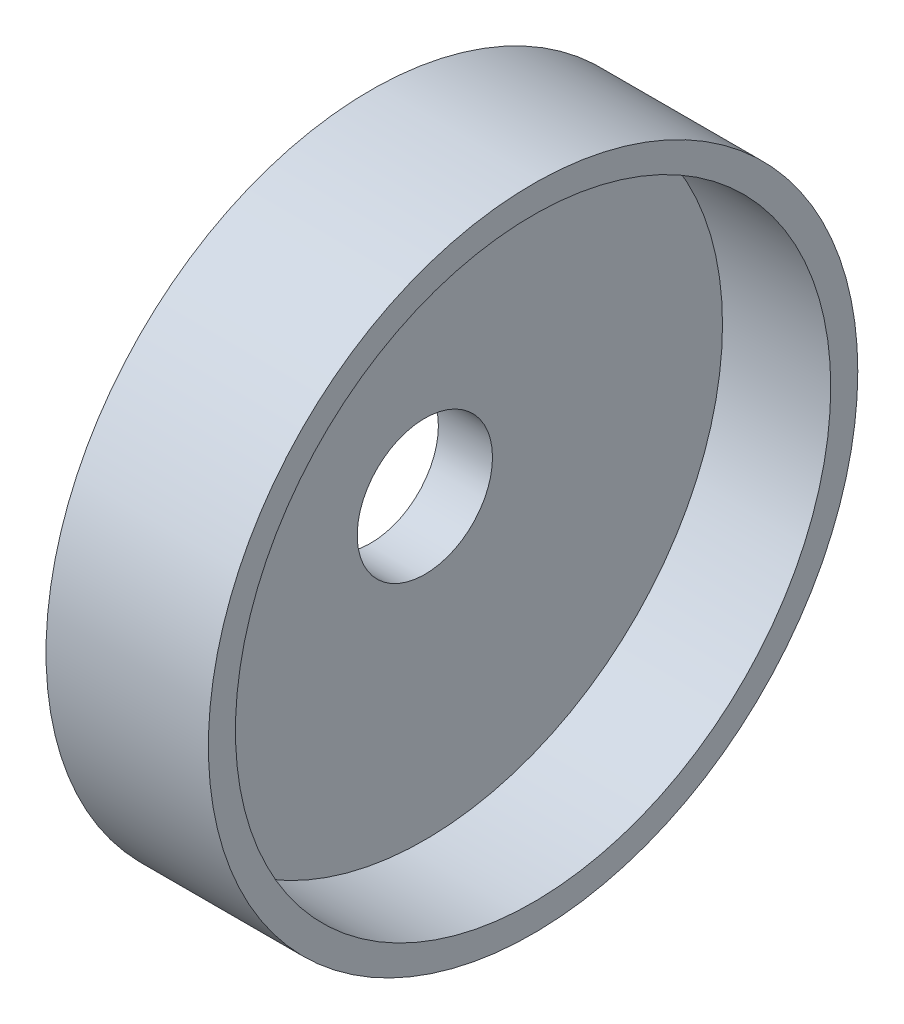
ISO-10303-21;
HEADER;
FILE_DESCRIPTION(('STEP AP214'),'2;1');
FILE_NAME('part.step','',(''),(''),'','','');
FILE_SCHEMA(('AUTOMOTIVE_DESIGN { 1 0 10303 214 1 1 1 1 }'));
ENDSEC;
DATA;
#1=APPLICATION_CONTEXT('core data for automotive mechanical design processes');
#2=APPLICATION_PROTOCOL_DEFINITION('international standard','automotive_design',2000,#1);
#3=PRODUCT_CONTEXT('',#1,'mechanical');
#4=PRODUCT('Part','Part','',(#3));
#5=PRODUCT_RELATED_PRODUCT_CATEGORY('part','',(#4));
#6=PRODUCT_DEFINITION_FORMATION('','',#4);
#7=PRODUCT_DEFINITION_CONTEXT('part definition',#1,'design');
#8=PRODUCT_DEFINITION('design','',#6,#7);
#9=PRODUCT_DEFINITION_SHAPE('','',#8);
#10=(LENGTH_UNIT() NAMED_UNIT(*) SI_UNIT(.MILLI.,.METRE.));
#11=(NAMED_UNIT(*) PLANE_ANGLE_UNIT() SI_UNIT($,.RADIAN.));
#12=(NAMED_UNIT(*) SI_UNIT($,.STERADIAN.) SOLID_ANGLE_UNIT());
#13=UNCERTAINTY_MEASURE_WITH_UNIT(LENGTH_MEASURE(1.E-05),#10,'distance_accuracy_value','');
#14=(GEOMETRIC_REPRESENTATION_CONTEXT(3) GLOBAL_UNCERTAINTY_ASSIGNED_CONTEXT((#13)) GLOBAL_UNIT_ASSIGNED_CONTEXT((#10,
#11,#12)) REPRESENTATION_CONTEXT('',''));
#15=CARTESIAN_POINT('',(0.,0.,0.));
#16=DIRECTION('',(0.,0.,1.));
#17=DIRECTION('',(1.,0.,0.));
#18=AXIS2_PLACEMENT_3D('',#15,#16,#17);
#19=CARTESIAN_POINT('',(10.,0.,0.));
#20=DIRECTION('',(-1.,0.,0.));
#21=DIRECTION('',(0.,0.,1.));
#22=AXIS2_PLACEMENT_3D('',#19,#20,#21);
#23=CYLINDRICAL_SURFACE('',#22,60.);
#24=CARTESIAN_POINT('',(0.,0.,0.));
#25=DIRECTION('',(1.,0.,0.));
#26=DIRECTION('',(0.,0.,-1.));
#27=AXIS2_PLACEMENT_3D('',#24,#25,#26);
#28=CIRCLE('',#27,60.);
#29=CARTESIAN_POINT('',(0.,0.,-60.));
#30=VERTEX_POINT('',#29);
#31=EDGE_CURVE('E36',#30,#30,#28,.T.);
#32=ORIENTED_EDGE('',*,*,#31,.T.);
#33=EDGE_LOOP('',(#32));
#34=FACE_BOUND('',#33,.T.);
#35=CARTESIAN_POINT('',(30.,0.,0.));
#36=DIRECTION('',(1.,0.,0.));
#37=DIRECTION('',(0.,0.,-1.));
#38=AXIS2_PLACEMENT_3D('',#35,#36,#37);
#39=CIRCLE('',#38,60.);
#40=CARTESIAN_POINT('',(30.,0.,-60.));
#41=VERTEX_POINT('',#40);
#42=EDGE_CURVE('E40',#41,#41,#39,.T.);
#43=ORIENTED_EDGE('',*,*,#42,.F.);
#44=EDGE_LOOP('',(#43));
#45=FACE_BOUND('',#44,.T.);
#46=ADVANCED_FACE('F30',(#34,#45),#23,.T.);
#47=CARTESIAN_POINT('',(0.,0.,0.));
#48=DIRECTION('',(1.,0.,0.));
#49=DIRECTION('',(0.,0.,-1.));
#50=AXIS2_PLACEMENT_3D('',#47,#48,#49);
#51=PLANE('',#50);
#52=CARTESIAN_POINT('',(0.,0.,0.));
#53=DIRECTION('',(1.,0.,0.));
#54=DIRECTION('',(0.,0.,-1.));
#55=AXIS2_PLACEMENT_3D('',#52,#53,#54);
#56=CIRCLE('',#55,12.5);
#57=CARTESIAN_POINT('',(0.,0.,-12.5));
#58=VERTEX_POINT('',#57);
#59=EDGE_CURVE('E49',#58,#58,#56,.T.);
#60=ORIENTED_EDGE('',*,*,#59,.T.);
#61=EDGE_LOOP('',(#60));
#62=FACE_BOUND('',#61,.T.);
#63=ORIENTED_EDGE('',*,*,#31,.F.);
#64=EDGE_LOOP('',(#63));
#65=FACE_BOUND('',#64,.T.);
#66=ADVANCED_FACE('F56',(#62,#65),#51,.F.);
#67=CARTESIAN_POINT('',(30.,0.,0.));
#68=DIRECTION('',(1.,0.,0.));
#69=DIRECTION('',(0.,0.,-1.));
#70=AXIS2_PLACEMENT_3D('',#67,#68,#69);
#71=PLANE('',#70);
#72=ORIENTED_EDGE('',*,*,#42,.T.);
#73=EDGE_LOOP('',(#72));
#74=FACE_BOUND('',#73,.T.);
#75=CARTESIAN_POINT('',(30.,0.,0.));
#76=DIRECTION('',(1.,0.,0.));
#77=DIRECTION('',(0.,0.,-1.));
#78=AXIS2_PLACEMENT_3D('',#75,#76,#77);
#79=CIRCLE('',#78,55.);
#80=CARTESIAN_POINT('',(30.,0.,-55.));
#81=VERTEX_POINT('',#80);
#82=EDGE_CURVE('E44',#81,#81,#79,.T.);
#83=ORIENTED_EDGE('',*,*,#82,.F.);
#84=EDGE_LOOP('',(#83));
#85=FACE_BOUND('',#84,.T.);
#86=ADVANCED_FACE('F73',(#74,#85),#71,.T.);
#87=CARTESIAN_POINT('',(30.,0.,0.));
#88=DIRECTION('',(-1.,0.,0.));
#89=DIRECTION('',(0.,0.,1.));
#90=AXIS2_PLACEMENT_3D('',#87,#88,#89);
#91=CYLINDRICAL_SURFACE('',#90,55.);
#92=ORIENTED_EDGE('',*,*,#82,.T.);
#93=EDGE_LOOP('',(#92));
#94=FACE_BOUND('',#93,.T.);
#95=CARTESIAN_POINT('',(10.,0.,0.));
#96=DIRECTION('',(1.,0.,0.));
#97=DIRECTION('',(0.,0.,-1.));
#98=AXIS2_PLACEMENT_3D('',#95,#96,#97);
#99=CIRCLE('',#98,55.);
#100=CARTESIAN_POINT('',(10.,0.,-55.));
#101=VERTEX_POINT('',#100);
#102=EDGE_CURVE('E10',#101,#101,#99,.F.);
#103=ORIENTED_EDGE('',*,*,#102,.T.);
#104=EDGE_LOOP('',(#103));
#105=FACE_BOUND('',#104,.T.);
#106=ADVANCED_FACE('F68',(#94,#105),#91,.F.);
#107=CARTESIAN_POINT('',(10.,0.,0.));
#108=DIRECTION('',(1.,0.,0.));
#109=DIRECTION('',(0.,0.,-1.));
#110=AXIS2_PLACEMENT_3D('',#107,#108,#109);
#111=PLANE('',#110);
#112=CARTESIAN_POINT('',(10.,0.,0.));
#113=DIRECTION('',(1.,0.,0.));
#114=DIRECTION('',(0.,0.,-1.));
#115=AXIS2_PLACEMENT_3D('',#112,#113,#114);
#116=CIRCLE('',#115,12.5);
#117=CARTESIAN_POINT('',(10.,0.,-12.5));
#118=VERTEX_POINT('',#117);
#119=EDGE_CURVE('E50',#118,#118,#116,.T.);
#120=ORIENTED_EDGE('',*,*,#119,.F.);
#121=EDGE_LOOP('',(#120));
#122=FACE_BOUND('',#121,.T.);
#123=ORIENTED_EDGE('',*,*,#102,.F.);
#124=EDGE_LOOP('',(#123));
#125=FACE_BOUND('',#124,.T.);
#126=ADVANCED_FACE('F62',(#122,#125),#111,.T.);
#127=CARTESIAN_POINT('',(0.,0.,0.));
#128=DIRECTION('',(1.,0.,0.));
#129=DIRECTION('',(0.,0.,-1.));
#130=AXIS2_PLACEMENT_3D('',#127,#128,#129);
#131=CYLINDRICAL_SURFACE('',#130,12.5);
#132=ORIENTED_EDGE('',*,*,#59,.F.);
#133=EDGE_LOOP('',(#132));
#134=FACE_BOUND('',#133,.T.);
#135=ORIENTED_EDGE('',*,*,#119,.T.);
#136=EDGE_LOOP('',(#135));
#137=FACE_BOUND('',#136,.T.);
#138=ADVANCED_FACE('F59',(#134,#137),#131,.F.);
#139=CLOSED_SHELL('',(#46,#66,#86,#106,#126,#138));
#140=MANIFOLD_SOLID_BREP('B2',#139);
#141=ADVANCED_BREP_SHAPE_REPRESENTATION('',(#18,#140),#14);
#142=SHAPE_DEFINITION_REPRESENTATION(#9,#141);
ENDSEC;
END-ISO-10303-21;
